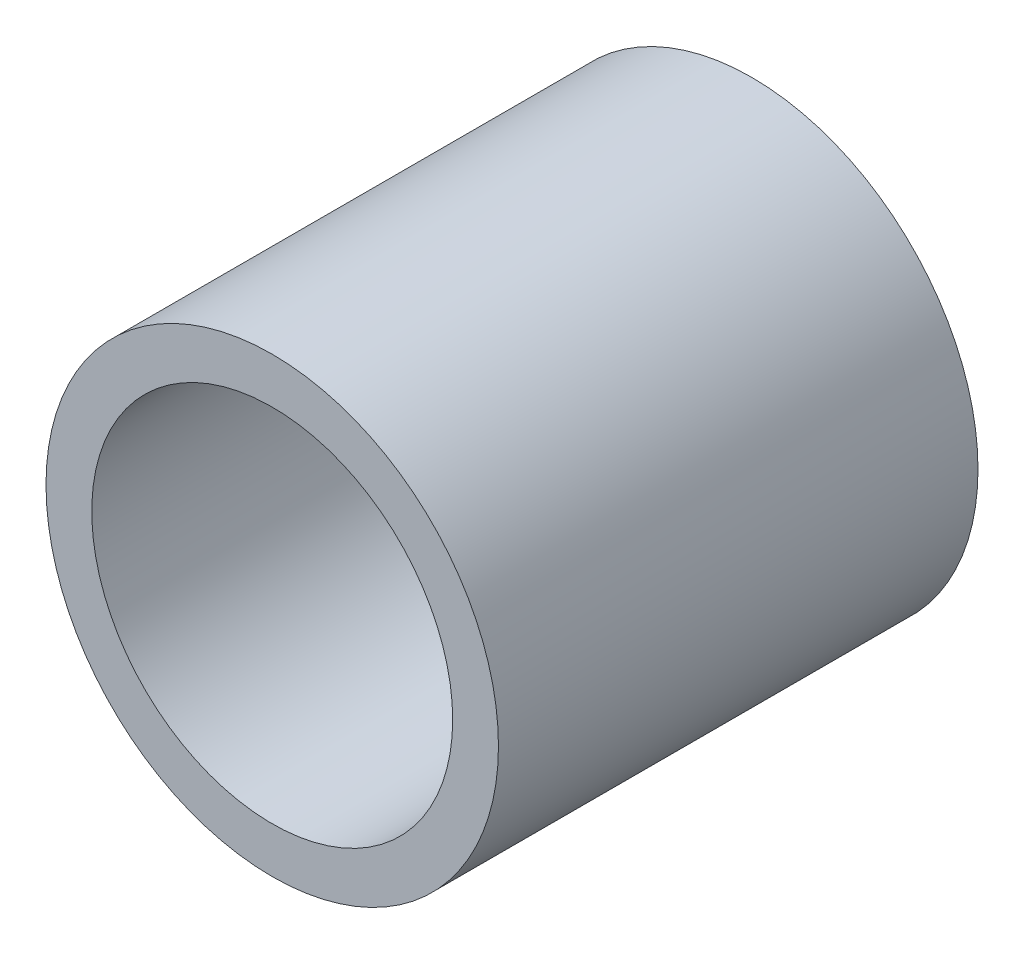
ISO-10303-21;
HEADER;
FILE_DESCRIPTION(('STEP AP214'),'2;1');
FILE_NAME('part.step','',(''),(''),'','','');
FILE_SCHEMA(('AUTOMOTIVE_DESIGN { 1 0 10303 214 1 1 1 1 }'));
ENDSEC;
DATA;
#1=APPLICATION_CONTEXT('core data for automotive mechanical design processes');
#2=APPLICATION_PROTOCOL_DEFINITION('international standard','automotive_design',2000,#1);
#3=PRODUCT_CONTEXT('',#1,'mechanical');
#4=PRODUCT('Part','Part','',(#3));
#5=PRODUCT_RELATED_PRODUCT_CATEGORY('part','',(#4));
#6=PRODUCT_DEFINITION_FORMATION('','',#4);
#7=PRODUCT_DEFINITION_CONTEXT('part definition',#1,'design');
#8=PRODUCT_DEFINITION('design','',#6,#7);
#9=PRODUCT_DEFINITION_SHAPE('','',#8);
#10=(LENGTH_UNIT() NAMED_UNIT(*) SI_UNIT(.MILLI.,.METRE.));
#11=(NAMED_UNIT(*) PLANE_ANGLE_UNIT() SI_UNIT($,.RADIAN.));
#12=(NAMED_UNIT(*) SI_UNIT($,.STERADIAN.) SOLID_ANGLE_UNIT());
#13=UNCERTAINTY_MEASURE_WITH_UNIT(LENGTH_MEASURE(1.E-05),#10,'distance_accuracy_value','');
#14=(GEOMETRIC_REPRESENTATION_CONTEXT(3) GLOBAL_UNCERTAINTY_ASSIGNED_CONTEXT((#13)) GLOBAL_UNIT_ASSIGNED_CONTEXT((#10,
#11,#12)) REPRESENTATION_CONTEXT('',''));
#15=CARTESIAN_POINT('',(0.,0.,0.));
#16=DIRECTION('',(0.,0.,1.));
#17=DIRECTION('',(1.,0.,0.));
#18=AXIS2_PLACEMENT_3D('',#15,#16,#17);
#19=CARTESIAN_POINT('',(0.,0.,35.4));
#20=DIRECTION('',(0.,0.,-1.));
#21=DIRECTION('',(-1.,0.,0.));
#22=AXIS2_PLACEMENT_3D('',#19,#20,#21);
#23=CYLINDRICAL_SURFACE('',#22,13.3223);
#24=CARTESIAN_POINT('',(0.,0.,35.4));
#25=DIRECTION('',(0.,0.,1.));
#26=DIRECTION('',(1.,0.,0.));
#27=AXIS2_PLACEMENT_3D('',#24,#25,#26);
#28=CIRCLE('',#27,13.3223);
#29=CARTESIAN_POINT('',(13.3223,0.,35.4));
#30=VERTEX_POINT('',#29);
#31=EDGE_CURVE('E45',#30,#30,#28,.T.);
#32=ORIENTED_EDGE('',*,*,#31,.T.);
#33=EDGE_LOOP('',(#32));
#34=FACE_BOUND('',#33,.T.);
#35=CARTESIAN_POINT('',(0.,0.,0.));
#36=DIRECTION('',(0.,0.,1.));
#37=DIRECTION('',(1.,0.,0.));
#38=AXIS2_PLACEMENT_3D('',#35,#36,#37);
#39=CIRCLE('',#38,13.3223);
#40=CARTESIAN_POINT('',(13.3223,0.,0.));
#41=VERTEX_POINT('',#40);
#42=EDGE_CURVE('E51',#41,#41,#39,.T.);
#43=ORIENTED_EDGE('',*,*,#42,.F.);
#44=EDGE_LOOP('',(#43));
#45=FACE_BOUND('',#44,.T.);
#46=ADVANCED_FACE('F38',(#34,#45),#23,.F.);
#47=CARTESIAN_POINT('',(0.,0.,35.4));
#48=DIRECTION('',(0.,0.,-1.));
#49=DIRECTION('',(-1.,0.,0.));
#50=AXIS2_PLACEMENT_3D('',#47,#48,#49);
#51=CYLINDRICAL_SURFACE('',#50,16.7005);
#52=CARTESIAN_POINT('',(0.,0.,35.4));
#53=DIRECTION('',(0.,0.,1.));
#54=DIRECTION('',(1.,0.,0.));
#55=AXIS2_PLACEMENT_3D('',#52,#53,#54);
#56=CIRCLE('',#55,16.7005);
#57=CARTESIAN_POINT('',(16.7005,0.,35.4));
#58=VERTEX_POINT('',#57);
#59=EDGE_CURVE('E11',#58,#58,#56,.T.);
#60=ORIENTED_EDGE('',*,*,#59,.F.);
#61=EDGE_LOOP('',(#60));
#62=FACE_BOUND('',#61,.T.);
#63=CARTESIAN_POINT('',(0.,0.,0.));
#64=DIRECTION('',(0.,0.,1.));
#65=DIRECTION('',(1.,0.,0.));
#66=AXIS2_PLACEMENT_3D('',#63,#64,#65);
#67=CIRCLE('',#66,16.7005);
#68=CARTESIAN_POINT('',(16.7005,0.,0.));
#69=VERTEX_POINT('',#68);
#70=EDGE_CURVE('E41',#69,#69,#67,.T.);
#71=ORIENTED_EDGE('',*,*,#70,.T.);
#72=EDGE_LOOP('',(#71));
#73=FACE_BOUND('',#72,.T.);
#74=ADVANCED_FACE('F58',(#62,#73),#51,.T.);
#75=CARTESIAN_POINT('',(0.,0.,35.4));
#76=DIRECTION('',(0.,0.,1.));
#77=DIRECTION('',(1.,0.,0.));
#78=AXIS2_PLACEMENT_3D('',#75,#76,#77);
#79=PLANE('',#78);
#80=ORIENTED_EDGE('',*,*,#31,.F.);
#81=EDGE_LOOP('',(#80));
#82=FACE_BOUND('',#81,.T.);
#83=ORIENTED_EDGE('',*,*,#59,.T.);
#84=EDGE_LOOP('',(#83));
#85=FACE_BOUND('',#84,.T.);
#86=ADVANCED_FACE('F62',(#82,#85),#79,.T.);
#87=CARTESIAN_POINT('',(0.,0.,0.));
#88=DIRECTION('',(0.,0.,1.));
#89=DIRECTION('',(1.,0.,0.));
#90=AXIS2_PLACEMENT_3D('',#87,#88,#89);
#91=PLANE('',#90);
#92=ORIENTED_EDGE('',*,*,#42,.T.);
#93=EDGE_LOOP('',(#92));
#94=FACE_BOUND('',#93,.T.);
#95=ORIENTED_EDGE('',*,*,#70,.F.);
#96=EDGE_LOOP('',(#95));
#97=FACE_BOUND('',#96,.T.);
#98=ADVANCED_FACE('F60',(#94,#97),#91,.F.);
#99=CLOSED_SHELL('',(#46,#74,#86,#98));
#100=MANIFOLD_SOLID_BREP('B2',#99);
#101=ADVANCED_BREP_SHAPE_REPRESENTATION('',(#18,#100),#14);
#102=SHAPE_DEFINITION_REPRESENTATION(#9,#101);
ENDSEC;
END-ISO-10303-21;
